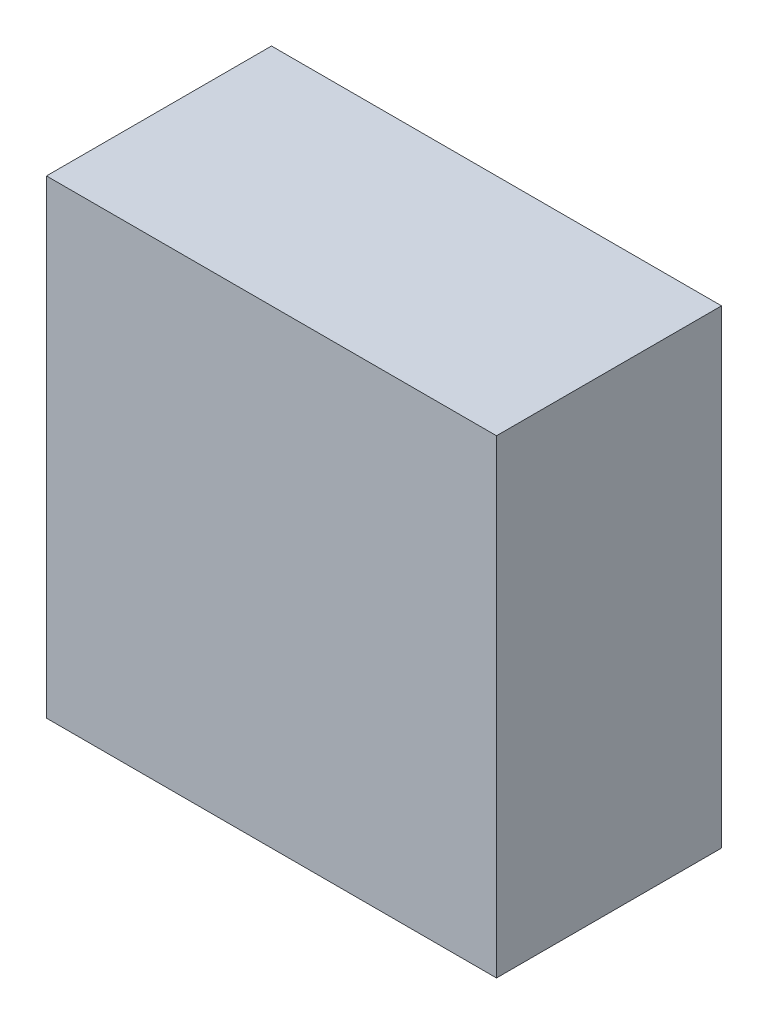
ISO-10303-21;
HEADER;
FILE_DESCRIPTION(('STEP AP214'),'2;1');
FILE_NAME('part.step','',(''),(''),'','','');
FILE_SCHEMA(('AUTOMOTIVE_DESIGN { 1 0 10303 214 1 1 1 1 }'));
ENDSEC;
DATA;
#1=APPLICATION_CONTEXT('core data for automotive mechanical design processes');
#2=APPLICATION_PROTOCOL_DEFINITION('international standard','automotive_design',2000,#1);
#3=PRODUCT_CONTEXT('',#1,'mechanical');
#4=PRODUCT('Part','Part','',(#3));
#5=PRODUCT_RELATED_PRODUCT_CATEGORY('part','',(#4));
#6=PRODUCT_DEFINITION_FORMATION('','',#4);
#7=PRODUCT_DEFINITION_CONTEXT('part definition',#1,'design');
#8=PRODUCT_DEFINITION('design','',#6,#7);
#9=PRODUCT_DEFINITION_SHAPE('','',#8);
#10=(LENGTH_UNIT() NAMED_UNIT(*) SI_UNIT(.MILLI.,.METRE.));
#11=(NAMED_UNIT(*) PLANE_ANGLE_UNIT() SI_UNIT($,.RADIAN.));
#12=(NAMED_UNIT(*) SI_UNIT($,.STERADIAN.) SOLID_ANGLE_UNIT());
#13=UNCERTAINTY_MEASURE_WITH_UNIT(LENGTH_MEASURE(1.E-05),#10,'distance_accuracy_value','');
#14=(GEOMETRIC_REPRESENTATION_CONTEXT(3) GLOBAL_UNCERTAINTY_ASSIGNED_CONTEXT((#13)) GLOBAL_UNIT_ASSIGNED_CONTEXT((#10,
#11,#12)) REPRESENTATION_CONTEXT('',''));
#15=CARTESIAN_POINT('',(0.,0.,0.));
#16=DIRECTION('',(0.,0.,1.));
#17=DIRECTION('',(1.,0.,0.));
#18=AXIS2_PLACEMENT_3D('',#15,#16,#17);
#19=CARTESIAN_POINT('',(0.,24.,0.));
#20=DIRECTION('',(1.,0.,0.));
#21=DIRECTION('',(0.,0.,-1.));
#22=AXIS2_PLACEMENT_3D('',#19,#20,#21);
#23=PLANE('',#22);
#24=DIRECTION('',(0.,0.,1.));
#25=VECTOR('',#24,1.);
#26=CARTESIAN_POINT('',(0.,0.,0.));
#27=LINE('',#26,#25);
#28=CARTESIAN_POINT('',(0.,0.,-11.5));
#29=VERTEX_POINT('',#28);
#30=CARTESIAN_POINT('',(0.,0.,0.));
#31=VERTEX_POINT('',#30);
#32=EDGE_CURVE('E111',#29,#31,#27,.T.);
#33=ORIENTED_EDGE('',*,*,#32,.T.);
#34=DIRECTION('',(0.,-1.,0.));
#35=VECTOR('',#34,1.);
#36=CARTESIAN_POINT('',(0.,24.,0.));
#37=LINE('',#36,#35);
#38=CARTESIAN_POINT('',(0.,24.,0.));
#39=VERTEX_POINT('',#38);
#40=EDGE_CURVE('E11',#39,#31,#37,.T.);
#41=ORIENTED_EDGE('',*,*,#40,.F.);
#42=DIRECTION('',(0.,0.,1.));
#43=VECTOR('',#42,1.);
#44=CARTESIAN_POINT('',(0.,24.,0.));
#45=LINE('',#44,#43);
#46=CARTESIAN_POINT('',(0.,24.,-11.5));
#47=VERTEX_POINT('',#46);
#48=EDGE_CURVE('E95',#47,#39,#45,.T.);
#49=ORIENTED_EDGE('',*,*,#48,.F.);
#50=DIRECTION('',(0.,-1.,0.));
#51=VECTOR('',#50,1.);
#52=CARTESIAN_POINT('',(0.,24.,-11.5));
#53=LINE('',#52,#51);
#54=EDGE_CURVE('E107',#47,#29,#53,.T.);
#55=ORIENTED_EDGE('',*,*,#54,.T.);
#56=EDGE_LOOP('',(#33,#41,#49,#55));
#57=FACE_BOUND('',#56,.T.);
#58=ADVANCED_FACE('F43',(#57),#23,.F.);
#59=CARTESIAN_POINT('',(0.,24.,0.));
#60=DIRECTION('',(0.,0.,-1.));
#61=DIRECTION('',(-1.,0.,0.));
#62=AXIS2_PLACEMENT_3D('',#59,#60,#61);
#63=PLANE('',#62);
#64=DIRECTION('',(1.,0.,0.));
#65=VECTOR('',#64,1.);
#66=CARTESIAN_POINT('',(0.,0.,0.));
#67=LINE('',#66,#65);
#68=CARTESIAN_POINT('',(23.,0.,0.));
#69=VERTEX_POINT('',#68);
#70=EDGE_CURVE('E100',#31,#69,#67,.T.);
#71=ORIENTED_EDGE('',*,*,#70,.T.);
#72=DIRECTION('',(0.,-1.,0.));
#73=VECTOR('',#72,1.);
#74=CARTESIAN_POINT('',(23.,24.,0.));
#75=LINE('',#74,#73);
#76=CARTESIAN_POINT('',(23.,24.,0.));
#77=VERTEX_POINT('',#76);
#78=EDGE_CURVE('E52',#77,#69,#75,.T.);
#79=ORIENTED_EDGE('',*,*,#78,.F.);
#80=DIRECTION('',(1.,0.,0.));
#81=VECTOR('',#80,1.);
#82=CARTESIAN_POINT('',(0.,24.,0.));
#83=LINE('',#82,#81);
#84=EDGE_CURVE('E90',#39,#77,#83,.T.);
#85=ORIENTED_EDGE('',*,*,#84,.F.);
#86=ORIENTED_EDGE('',*,*,#40,.T.);
#87=EDGE_LOOP('',(#71,#79,#85,#86));
#88=FACE_BOUND('',#87,.T.);
#89=ADVANCED_FACE('F99',(#88),#63,.F.);
#90=CARTESIAN_POINT('',(23.,24.,0.));
#91=DIRECTION('',(-1.,0.,0.));
#92=DIRECTION('',(0.,0.,1.));
#93=AXIS2_PLACEMENT_3D('',#90,#91,#92);
#94=PLANE('',#93);
#95=DIRECTION('',(0.,0.,-1.));
#96=VECTOR('',#95,1.);
#97=CARTESIAN_POINT('',(23.,0.,0.));
#98=LINE('',#97,#96);
#99=CARTESIAN_POINT('',(23.,0.,-11.5));
#100=VERTEX_POINT('',#99);
#101=EDGE_CURVE('E77',#69,#100,#98,.T.);
#102=ORIENTED_EDGE('',*,*,#101,.T.);
#103=DIRECTION('',(0.,-1.,0.));
#104=VECTOR('',#103,1.);
#105=CARTESIAN_POINT('',(23.,24.,-11.5));
#106=LINE('',#105,#104);
#107=CARTESIAN_POINT('',(23.,24.,-11.5));
#108=VERTEX_POINT('',#107);
#109=EDGE_CURVE('E102',#108,#100,#106,.T.);
#110=ORIENTED_EDGE('',*,*,#109,.F.);
#111=DIRECTION('',(0.,0.,-1.));
#112=VECTOR('',#111,1.);
#113=CARTESIAN_POINT('',(23.,24.,0.));
#114=LINE('',#113,#112);
#115=EDGE_CURVE('E93',#77,#108,#114,.T.);
#116=ORIENTED_EDGE('',*,*,#115,.F.);
#117=ORIENTED_EDGE('',*,*,#78,.T.);
#118=EDGE_LOOP('',(#102,#110,#116,#117));
#119=FACE_BOUND('',#118,.T.);
#120=ADVANCED_FACE('F103',(#119),#94,.F.);
#121=CARTESIAN_POINT('',(0.,24.,-11.5));
#122=DIRECTION('',(0.,0.,1.));
#123=DIRECTION('',(1.,0.,0.));
#124=AXIS2_PLACEMENT_3D('',#121,#122,#123);
#125=PLANE('',#124);
#126=DIRECTION('',(-1.,0.,0.));
#127=VECTOR('',#126,1.);
#128=CARTESIAN_POINT('',(0.,0.,-11.5));
#129=LINE('',#128,#127);
#130=EDGE_CURVE('E83',#100,#29,#129,.T.);
#131=ORIENTED_EDGE('',*,*,#130,.T.);
#132=ORIENTED_EDGE('',*,*,#54,.F.);
#133=DIRECTION('',(-1.,0.,0.));
#134=VECTOR('',#133,1.);
#135=CARTESIAN_POINT('',(0.,24.,-11.5));
#136=LINE('',#135,#134);
#137=EDGE_CURVE('E60',#108,#47,#136,.T.);
#138=ORIENTED_EDGE('',*,*,#137,.F.);
#139=ORIENTED_EDGE('',*,*,#109,.T.);
#140=EDGE_LOOP('',(#131,#132,#138,#139));
#141=FACE_BOUND('',#140,.T.);
#142=ADVANCED_FACE('F124',(#141),#125,.F.);
#143=CARTESIAN_POINT('',(0.,24.,0.));
#144=DIRECTION('',(0.,-1.,0.));
#145=DIRECTION('',(0.,0.,-1.));
#146=AXIS2_PLACEMENT_3D('',#143,#144,#145);
#147=PLANE('',#146);
#148=ORIENTED_EDGE('',*,*,#48,.T.);
#149=ORIENTED_EDGE('',*,*,#84,.T.);
#150=ORIENTED_EDGE('',*,*,#115,.T.);
#151=ORIENTED_EDGE('',*,*,#137,.T.);
#152=EDGE_LOOP('',(#148,#149,#150,#151));
#153=FACE_BOUND('',#152,.T.);
#154=ADVANCED_FACE('F91',(#153),#147,.F.);
#155=CARTESIAN_POINT('',(0.,0.,0.));
#156=DIRECTION('',(0.,-1.,0.));
#157=DIRECTION('',(0.,0.,-1.));
#158=AXIS2_PLACEMENT_3D('',#155,#156,#157);
#159=PLANE('',#158);
#160=ORIENTED_EDGE('',*,*,#32,.F.);
#161=ORIENTED_EDGE('',*,*,#130,.F.);
#162=ORIENTED_EDGE('',*,*,#101,.F.);
#163=ORIENTED_EDGE('',*,*,#70,.F.);
#164=EDGE_LOOP('',(#160,#161,#162,#163));
#165=FACE_BOUND('',#164,.T.);
#166=ADVANCED_FACE('F127',(#165),#159,.T.);
#167=CLOSED_SHELL('',(#58,#89,#120,#142,#154,#166));
#168=MANIFOLD_SOLID_BREP('B2',#167);
#169=ADVANCED_BREP_SHAPE_REPRESENTATION('',(#18,#168),#14);
#170=SHAPE_DEFINITION_REPRESENTATION(#9,#169);
ENDSEC;
END-ISO-10303-21;
